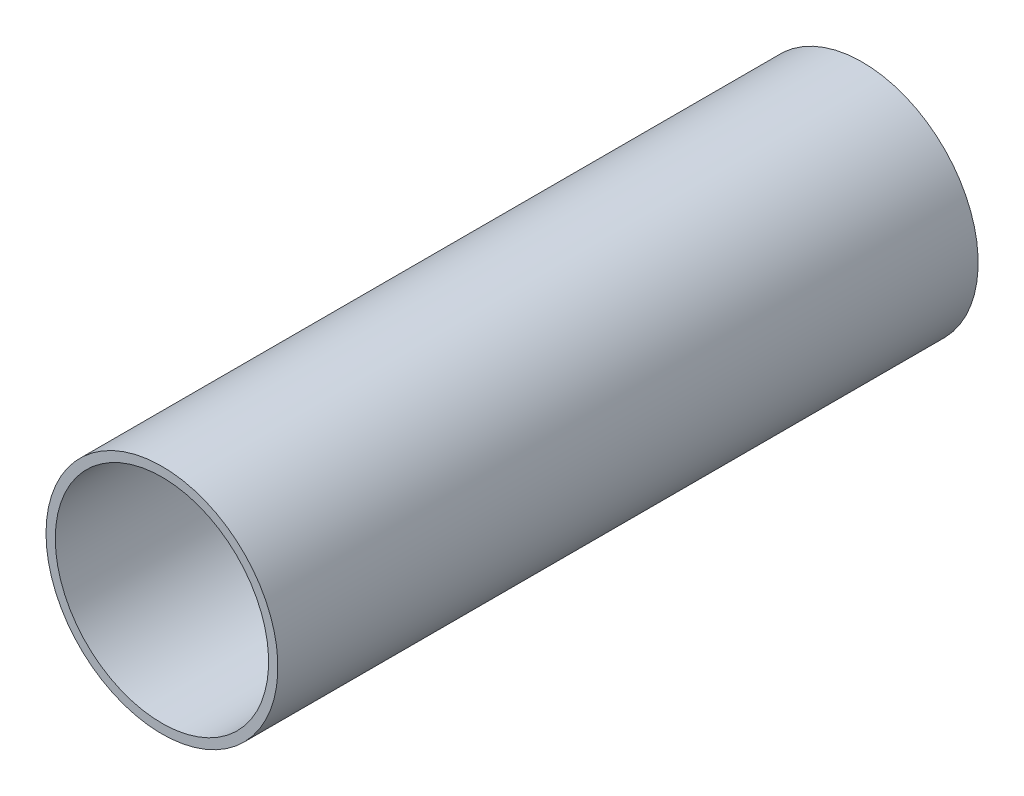
ISO-10303-21;
HEADER;
FILE_DESCRIPTION(('STEP AP214'),'2;1');
FILE_NAME('part.step','',(''),(''),'','','');
FILE_SCHEMA(('AUTOMOTIVE_DESIGN { 1 0 10303 214 1 1 1 1 }'));
ENDSEC;
DATA;
#1=APPLICATION_CONTEXT('core data for automotive mechanical design processes');
#2=APPLICATION_PROTOCOL_DEFINITION('international standard','automotive_design',2000,#1);
#3=PRODUCT_CONTEXT('',#1,'mechanical');
#4=PRODUCT('Part','Part','',(#3));
#5=PRODUCT_RELATED_PRODUCT_CATEGORY('part','',(#4));
#6=PRODUCT_DEFINITION_FORMATION('','',#4);
#7=PRODUCT_DEFINITION_CONTEXT('part definition',#1,'design');
#8=PRODUCT_DEFINITION('design','',#6,#7);
#9=PRODUCT_DEFINITION_SHAPE('','',#8);
#10=(LENGTH_UNIT() NAMED_UNIT(*) SI_UNIT(.MILLI.,.METRE.));
#11=(NAMED_UNIT(*) PLANE_ANGLE_UNIT() SI_UNIT($,.RADIAN.));
#12=(NAMED_UNIT(*) SI_UNIT($,.STERADIAN.) SOLID_ANGLE_UNIT());
#13=UNCERTAINTY_MEASURE_WITH_UNIT(LENGTH_MEASURE(1.E-05),#10,'distance_accuracy_value','');
#14=(GEOMETRIC_REPRESENTATION_CONTEXT(3) GLOBAL_UNCERTAINTY_ASSIGNED_CONTEXT((#13)) GLOBAL_UNIT_ASSIGNED_CONTEXT((#10,
#11,#12)) REPRESENTATION_CONTEXT('',''));
#15=CARTESIAN_POINT('',(0.,0.,0.));
#16=DIRECTION('',(0.,0.,1.));
#17=DIRECTION('',(1.,0.,0.));
#18=AXIS2_PLACEMENT_3D('',#15,#16,#17);
#19=CARTESIAN_POINT('',(0.,0.,-100.9));
#20=DIRECTION('',(0.,0.,-1.));
#21=DIRECTION('',(-1.,0.,0.));
#22=AXIS2_PLACEMENT_3D('',#19,#20,#21);
#23=PLANE('',#22);
#24=CARTESIAN_POINT('',(0.,0.,-100.9));
#25=DIRECTION('',(0.,0.,-1.));
#26=DIRECTION('',(-1.,0.,0.));
#27=AXIS2_PLACEMENT_3D('',#24,#25,#26);
#28=CIRCLE('',#27,12.5);
#29=CARTESIAN_POINT('',(-12.5,0.,-100.9));
#30=VERTEX_POINT('',#29);
#31=EDGE_CURVE('E10',#30,#30,#28,.T.);
#32=ORIENTED_EDGE('',*,*,#31,.T.);
#33=EDGE_LOOP('',(#32));
#34=FACE_BOUND('',#33,.T.);
#35=CARTESIAN_POINT('',(0.,0.,-100.9));
#36=DIRECTION('',(0.,0.,-1.));
#37=DIRECTION('',(-1.,0.,0.));
#38=AXIS2_PLACEMENT_3D('',#35,#36,#37);
#39=CIRCLE('',#38,11.5);
#40=CARTESIAN_POINT('',(-11.5,0.,-100.9));
#41=VERTEX_POINT('',#40);
#42=EDGE_CURVE('E44',#41,#41,#39,.T.);
#43=ORIENTED_EDGE('',*,*,#42,.F.);
#44=EDGE_LOOP('',(#43));
#45=FACE_BOUND('',#44,.T.);
#46=ADVANCED_FACE('F33',(#34,#45),#23,.T.);
#47=CARTESIAN_POINT('',(0.,0.,-25.4));
#48=DIRECTION('',(0.,0.,-1.));
#49=DIRECTION('',(-1.,0.,0.));
#50=AXIS2_PLACEMENT_3D('',#47,#48,#49);
#51=PLANE('',#50);
#52=CARTESIAN_POINT('',(0.,0.,-25.4));
#53=DIRECTION('',(0.,0.,-1.));
#54=DIRECTION('',(-1.,0.,0.));
#55=AXIS2_PLACEMENT_3D('',#52,#53,#54);
#56=CIRCLE('',#55,12.5);
#57=CARTESIAN_POINT('',(-12.5,0.,-25.4));
#58=VERTEX_POINT('',#57);
#59=EDGE_CURVE('E37',#58,#58,#56,.T.);
#60=ORIENTED_EDGE('',*,*,#59,.F.);
#61=EDGE_LOOP('',(#60));
#62=FACE_BOUND('',#61,.T.);
#63=CARTESIAN_POINT('',(0.,0.,-25.4));
#64=DIRECTION('',(0.,0.,-1.));
#65=DIRECTION('',(-1.,0.,0.));
#66=AXIS2_PLACEMENT_3D('',#63,#64,#65);
#67=CIRCLE('',#66,11.5);
#68=CARTESIAN_POINT('',(-11.5,0.,-25.4));
#69=VERTEX_POINT('',#68);
#70=EDGE_CURVE('E46',#69,#69,#67,.T.);
#71=ORIENTED_EDGE('',*,*,#70,.T.);
#72=EDGE_LOOP('',(#71));
#73=FACE_BOUND('',#72,.T.);
#74=ADVANCED_FACE('F56',(#62,#73),#51,.F.);
#75=CARTESIAN_POINT('',(0.,0.,-100.9));
#76=DIRECTION('',(0.,0.,1.));
#77=DIRECTION('',(1.,0.,0.));
#78=AXIS2_PLACEMENT_3D('',#75,#76,#77);
#79=CYLINDRICAL_SURFACE('',#78,12.5);
#80=ORIENTED_EDGE('',*,*,#31,.F.);
#81=EDGE_LOOP('',(#80));
#82=FACE_BOUND('',#81,.T.);
#83=ORIENTED_EDGE('',*,*,#59,.T.);
#84=EDGE_LOOP('',(#83));
#85=FACE_BOUND('',#84,.T.);
#86=ADVANCED_FACE('F35',(#82,#85),#79,.T.);
#87=CARTESIAN_POINT('',(0.,0.,-100.9));
#88=DIRECTION('',(0.,0.,1.));
#89=DIRECTION('',(1.,0.,0.));
#90=AXIS2_PLACEMENT_3D('',#87,#88,#89);
#91=CYLINDRICAL_SURFACE('',#90,11.5);
#92=ORIENTED_EDGE('',*,*,#42,.T.);
#93=EDGE_LOOP('',(#92));
#94=FACE_BOUND('',#93,.T.);
#95=ORIENTED_EDGE('',*,*,#70,.F.);
#96=EDGE_LOOP('',(#95));
#97=FACE_BOUND('',#96,.T.);
#98=ADVANCED_FACE('F52',(#94,#97),#91,.F.);
#99=CLOSED_SHELL('',(#46,#74,#86,#98));
#100=MANIFOLD_SOLID_BREP('B2',#99);
#101=ADVANCED_BREP_SHAPE_REPRESENTATION('',(#18,#100),#14);
#102=SHAPE_DEFINITION_REPRESENTATION(#9,#101);
ENDSEC;
END-ISO-10303-21;
